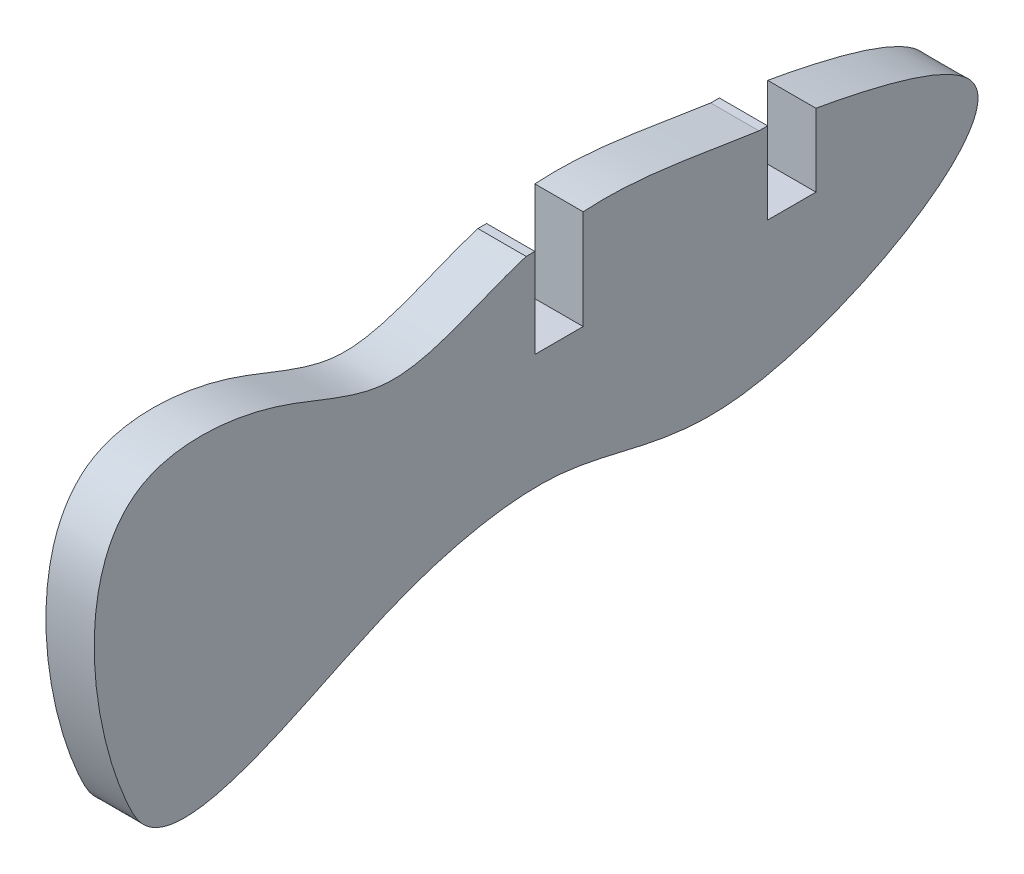
ISO-10303-21;
HEADER;
FILE_DESCRIPTION(('STEP AP214'),'2;1');
FILE_NAME('part.step','',(''),(''),'','','');
FILE_SCHEMA(('AUTOMOTIVE_DESIGN { 1 0 10303 214 1 1 1 1 }'));
ENDSEC;
DATA;
#1=APPLICATION_CONTEXT('core data for automotive mechanical design processes');
#2=APPLICATION_PROTOCOL_DEFINITION('international standard','automotive_design',2000,#1);
#3=PRODUCT_CONTEXT('',#1,'mechanical');
#4=PRODUCT('Part','Part','',(#3));
#5=PRODUCT_RELATED_PRODUCT_CATEGORY('part','',(#4));
#6=PRODUCT_DEFINITION_FORMATION('','',#4);
#7=PRODUCT_DEFINITION_CONTEXT('part definition',#1,'design');
#8=PRODUCT_DEFINITION('design','',#6,#7);
#9=PRODUCT_DEFINITION_SHAPE('','',#8);
#10=(LENGTH_UNIT() NAMED_UNIT(*) SI_UNIT(.MILLI.,.METRE.));
#11=(NAMED_UNIT(*) PLANE_ANGLE_UNIT() SI_UNIT($,.RADIAN.));
#12=(NAMED_UNIT(*) SI_UNIT($,.STERADIAN.) SOLID_ANGLE_UNIT());
#13=UNCERTAINTY_MEASURE_WITH_UNIT(LENGTH_MEASURE(1.E-05),#10,'distance_accuracy_value','');
#14=(GEOMETRIC_REPRESENTATION_CONTEXT(3) GLOBAL_UNCERTAINTY_ASSIGNED_CONTEXT((#13)) GLOBAL_UNIT_ASSIGNED_CONTEXT((#10,
#11,#12)) REPRESENTATION_CONTEXT('',''));
#15=CARTESIAN_POINT('',(0.,0.,0.));
#16=DIRECTION('',(0.,0.,1.));
#17=DIRECTION('',(1.,0.,0.));
#18=AXIS2_PLACEMENT_3D('',#15,#16,#17);
#19=CARTESIAN_POINT('',(-3.,14.1096357566499,-36.9591158688873));
#20=DIRECTION('',(1.,0.,0.));
#21=DIRECTION('',(0.,0.,-1.));
#22=AXIS2_PLACEMENT_3D('',#19,#20,#21);
#23=PLANE('',#22);
#24=DIRECTION('',(0.,0.,1.));
#25=VECTOR('',#24,1.);
#26=CARTESIAN_POINT('',(-3.,14.9506598821932,-32.05));
#27=LINE('',#26,#25);
#28=CARTESIAN_POINT('',(-3.,14.9506598821932,-32.5));
#29=VERTEX_POINT('',#28);
#30=CARTESIAN_POINT('',(-3.,14.9506598821932,-32.05));
#31=VERTEX_POINT('',#30);
#32=EDGE_CURVE('E125',#29,#31,#27,.T.);
#33=ORIENTED_EDGE('',*,*,#32,.T.);
#34=CARTESIAN_POINT('',(-3.,0.,0.));
#35=CARTESIAN_POINT('',(-3.,-2.10148899975761,-1.66824242640622));
#36=CARTESIAN_POINT('',(-3.,0.830537742946597,-8.40243383356885));
#37=CARTESIAN_POINT('',(-3.,3.85917268310027,-14.2712684107008));
#38=CARTESIAN_POINT('',(-3.,5.60522810441731,-22.4185256442143));
#39=CARTESIAN_POINT('',(-3.,1.00861388127118,-31.161172034736));
#40=CARTESIAN_POINT('',(-3.,10.8666316204562,-48.5539259527911));
#41=CARTESIAN_POINT('',(-3.,14.3286116729627,-36.875001757179));
#42=CARTESIAN_POINT('',(-3.,15.1694073837685,-29.9079989126778));
#43=CARTESIAN_POINT('',(-3.,16.9302814357476,-21.2011380590038));
#44=CARTESIAN_POINT('',(-3.,11.9338438664277,-13.4360646383816));
#45=CARTESIAN_POINT('',(-3.,15.6501057152965,-7.10719668173799));
#46=CARTESIAN_POINT('',(-3.,16.4810271321078,3.85111381370628));
#47=CARTESIAN_POINT('',(-3.,4.93290760788079,2.56569198647616));
#48=CARTESIAN_POINT('',(-3.,0.304319116234114,0.241580165742837));
#49=CARTESIAN_POINT('',(-3.,0.,0.));
#50=B_SPLINE_CURVE_WITH_KNOTS('',3,(#34,#35,#36,#37,#38,#39,#40,#41,#42,#43,#44,#45,#46,#47,#48,
#49),.UNSPECIFIED.,.T.,.F.,(4,1,1,1,1,1,1,1,1,1,1,1,1,4),(0.,0.082216534757164,
0.139216971510649,0.210483647825713,0.297081423388833,0.437894771987151,0.494452543094056,
0.559622012948284,0.657118762816807,0.731041248773184,0.790062711821896,0.856751927191223,
0.988094126022065,1.),.UNSPECIFIED.);
#51=CARTESIAN_POINT('',(-3.,15.8747427119938,-22.95));
#52=VERTEX_POINT('',#51);
#53=EDGE_CURVE('E217',#31,#52,#50,.T.);
#54=ORIENTED_EDGE('',*,*,#53,.T.);
#55=DIRECTION('',(0.,1.,0.));
#56=VECTOR('',#55,1.);
#57=CARTESIAN_POINT('',(-3.,15.909551198777,-22.95));
#58=LINE('',#57,#56);
#59=CARTESIAN_POINT('',(-3.,10.7286242334819,-22.95));
#60=VERTEX_POINT('',#59);
#61=EDGE_CURVE('E201',#60,#52,#58,.T.);
#62=ORIENTED_EDGE('',*,*,#61,.F.);
#63=DIRECTION('',(0.,0.,1.));
#64=VECTOR('',#63,1.);
#65=CARTESIAN_POINT('',(-3.,10.7286242334819,-22.95));
#66=LINE('',#65,#64);
#67=CARTESIAN_POINT('',(-3.,10.7286242334819,-20.45));
#68=VERTEX_POINT('',#67);
#69=EDGE_CURVE('E206',#60,#68,#66,.T.);
#70=ORIENTED_EDGE('',*,*,#69,.T.);
#71=DIRECTION('',(0.,1.,0.));
#72=VECTOR('',#71,1.);
#73=CARTESIAN_POINT('',(-3.,15.3475408108748,-20.45));
#74=LINE('',#73,#72);
#75=CARTESIAN_POINT('',(-3.,15.3475408108748,-20.45));
#76=VERTEX_POINT('',#75);
#77=EDGE_CURVE('E129',#68,#76,#74,.T.);
#78=ORIENTED_EDGE('',*,*,#77,.T.);
#79=DIRECTION('',(0.,0.,1.));
#80=VECTOR('',#79,1.);
#81=CARTESIAN_POINT('',(-3.,15.3475408108748,-20.0000000000005));
#82=LINE('',#81,#80);
#83=CARTESIAN_POINT('',(-3.,15.3475408108748,-20.0000000000005));
#84=VERTEX_POINT('',#83);
#85=EDGE_CURVE('E155',#76,#84,#82,.T.);
#86=ORIENTED_EDGE('',*,*,#85,.T.);
#87=CARTESIAN_POINT('',(-3.,14.4882185526725,-35.));
#88=VERTEX_POINT('',#87);
#89=EDGE_CURVE('E218',#84,#88,#50,.T.);
#90=ORIENTED_EDGE('',*,*,#89,.T.);
#91=DIRECTION('',(0.,1.,0.));
#92=VECTOR('',#91,1.);
#93=CARTESIAN_POINT('',(-3.,15.909551198777,-35.));
#94=LINE('',#93,#92);
#95=CARTESIAN_POINT('',(-3.,10.7286242334819,-35.));
#96=VERTEX_POINT('',#95);
#97=EDGE_CURVE('E168',#96,#88,#94,.T.);
#98=ORIENTED_EDGE('',*,*,#97,.F.);
#99=DIRECTION('',(0.,0.,-1.));
#100=VECTOR('',#99,1.);
#101=CARTESIAN_POINT('',(-3.,10.7286242334819,-32.05));
#102=LINE('',#101,#100);
#103=CARTESIAN_POINT('',(-3.,10.7286242334819,-32.5));
#104=VERTEX_POINT('',#103);
#105=EDGE_CURVE('E181',#104,#96,#102,.T.);
#106=ORIENTED_EDGE('',*,*,#105,.F.);
#107=DIRECTION('',(0.,1.,0.));
#108=VECTOR('',#107,1.);
#109=CARTESIAN_POINT('',(-3.,14.9506598821932,-32.5));
#110=LINE('',#109,#108);
#111=EDGE_CURVE('E145',#104,#29,#110,.T.);
#112=ORIENTED_EDGE('',*,*,#111,.T.);
#113=EDGE_LOOP('',(#33,#54,#62,#70,#78,#86,#90,#98,#106,#112));
#114=FACE_BOUND('',#113,.T.);
#115=ADVANCED_FACE('F39',(#114),#23,.T.);
#116=CARTESIAN_POINT('',(-5.5,0.,0.));
#117=CARTESIAN_POINT('',(-5.5,-2.10148899975761,-1.66824242640622));
#118=CARTESIAN_POINT('',(-5.5,0.830537742946597,-8.40243383356885));
#119=CARTESIAN_POINT('',(-5.5,3.85917268310027,-14.2712684107008));
#120=CARTESIAN_POINT('',(-5.5,5.60522810441731,-22.4185256442143));
#121=CARTESIAN_POINT('',(-5.5,1.00861388127118,-31.161172034736));
#122=CARTESIAN_POINT('',(-5.5,10.8666316204562,-48.5539259527911));
#123=CARTESIAN_POINT('',(-5.5,14.3286116729627,-36.875001757179));
#124=CARTESIAN_POINT('',(-5.5,15.1694073837685,-29.9079989126778));
#125=CARTESIAN_POINT('',(-5.5,16.9302814357476,-21.2011380590038));
#126=CARTESIAN_POINT('',(-5.5,11.9338438664277,-13.4360646383816));
#127=CARTESIAN_POINT('',(-5.5,15.6501057152965,-7.10719668173799));
#128=CARTESIAN_POINT('',(-5.5,16.4810271321078,3.85111381370628));
#129=CARTESIAN_POINT('',(-5.5,4.93290760788079,2.56569198647616));
#130=CARTESIAN_POINT('',(-5.5,0.304319116234114,0.241580165742837));
#131=CARTESIAN_POINT('',(-5.5,0.,0.));
#132=B_SPLINE_CURVE_WITH_KNOTS('',3,(#116,#117,#118,#119,#120,#121,#122,#123,#124,#125,#126,
#127,#128,#129,#130,#131),.UNSPECIFIED.,.T.,.F.,(4,1,1,1,1,1,1,1,1,1,1,1,1,4),(0.,
0.082216534757164,0.139216971510649,0.210483647825713,0.297081423388833,0.437894771987151,
0.494452543094056,0.559622012948284,0.657118762816807,0.731041248773184,0.790062711821896,
0.856751927191223,0.988094126022065,1.),.UNSPECIFIED.);
#133=DIRECTION('',(1.,0.,0.));
#134=VECTOR('',#133,1.);
#135=SURFACE_OF_LINEAR_EXTRUSION('',#132,#134);
#136=DIRECTION('',(1.,0.,0.));
#137=VECTOR('',#136,1.);
#138=CARTESIAN_POINT('',(-5.5,14.9506598836708,-32.05));
#139=LINE('',#138,#137);
#140=CARTESIAN_POINT('',(-5.5,14.9506598821932,-32.05));
#141=VERTEX_POINT('',#140);
#142=EDGE_CURVE('E191',#141,#31,#139,.T.);
#143=ORIENTED_EDGE('',*,*,#142,.F.);
#144=CARTESIAN_POINT('',(-5.5,15.8747427119938,-22.95));
#145=VERTEX_POINT('',#144);
#146=EDGE_CURVE('E51',#141,#145,#132,.T.);
#147=ORIENTED_EDGE('',*,*,#146,.T.);
#148=DIRECTION('',(1.,0.,0.));
#149=VECTOR('',#148,1.);
#150=CARTESIAN_POINT('',(-5.5,15.8747427129041,-22.95));
#151=LINE('',#150,#149);
#152=EDGE_CURVE('E214',#52,#145,#151,.F.);
#153=ORIENTED_EDGE('',*,*,#152,.F.);
#154=ORIENTED_EDGE('',*,*,#53,.F.);
#155=EDGE_LOOP('',(#143,#147,#153,#154));
#156=FACE_BOUND('',#155,.T.);
#157=ADVANCED_FACE('F41',(#156),#135,.T.);
#158=CARTESIAN_POINT('',(-5.5,15.3475408108748,-20.));
#159=VERTEX_POINT('',#158);
#160=CARTESIAN_POINT('',(-5.5,14.4882185526725,-35.));
#161=VERTEX_POINT('',#160);
#162=EDGE_CURVE('E11',#159,#161,#132,.T.);
#163=ORIENTED_EDGE('',*,*,#162,.T.);
#164=DIRECTION('',(1.,0.,0.));
#165=VECTOR('',#164,1.);
#166=CARTESIAN_POINT('',(-5.5,14.4882185526727,-35.));
#167=LINE('',#166,#165);
#168=EDGE_CURVE('E187',#161,#88,#167,.T.);
#169=ORIENTED_EDGE('',*,*,#168,.T.);
#170=ORIENTED_EDGE('',*,*,#89,.F.);
#171=DIRECTION('',(1.,0.,0.));
#172=VECTOR('',#171,1.);
#173=CARTESIAN_POINT('',(-5.5,15.3475408108746,-20.));
#174=LINE('',#173,#172);
#175=EDGE_CURVE('E209',#84,#159,#174,.F.);
#176=ORIENTED_EDGE('',*,*,#175,.T.);
#177=EDGE_LOOP('',(#163,#169,#170,#176));
#178=FACE_BOUND('',#177,.T.);
#179=ADVANCED_FACE('F238',(#178),#135,.T.);
#180=CARTESIAN_POINT('',(-3.,10.7286242334819,-32.05));
#181=DIRECTION('',(0.,-1.,0.));
#182=DIRECTION('',(0.,0.,1.));
#183=AXIS2_PLACEMENT_3D('',#180,#181,#182);
#184=PLANE('',#183);
#185=DIRECTION('',(0.,0.,-1.));
#186=VECTOR('',#185,1.);
#187=CARTESIAN_POINT('',(-5.5,10.7286242334819,-32.05));
#188=LINE('',#187,#186);
#189=CARTESIAN_POINT('',(-5.5,10.7286242334819,-32.5));
#190=VERTEX_POINT('',#189);
#191=CARTESIAN_POINT('',(-5.5,10.7286242334819,-35.));
#192=VERTEX_POINT('',#191);
#193=EDGE_CURVE('E184',#190,#192,#188,.T.);
#194=ORIENTED_EDGE('',*,*,#193,.F.);
#195=DIRECTION('',(1.,0.,0.));
#196=VECTOR('',#195,1.);
#197=CARTESIAN_POINT('',(-5.5,10.7286242334819,-32.5));
#198=LINE('',#197,#196);
#199=EDGE_CURVE('E130',#190,#104,#198,.T.);
#200=ORIENTED_EDGE('',*,*,#199,.T.);
#201=ORIENTED_EDGE('',*,*,#105,.T.);
#202=DIRECTION('',(1.,0.,0.));
#203=VECTOR('',#202,1.);
#204=CARTESIAN_POINT('',(-3.,10.7286242334819,-35.));
#205=LINE('',#204,#203);
#206=EDGE_CURVE('E173',#192,#96,#205,.T.);
#207=ORIENTED_EDGE('',*,*,#206,.F.);
#208=EDGE_LOOP('',(#194,#200,#201,#207));
#209=FACE_BOUND('',#208,.T.);
#210=ADVANCED_FACE('F243',(#209),#184,.F.);
#211=CARTESIAN_POINT('',(0.,0.,-35.));
#212=DIRECTION('',(0.,0.,1.));
#213=DIRECTION('',(-1.,0.,0.));
#214=AXIS2_PLACEMENT_3D('',#211,#212,#213);
#215=PLANE('',#214);
#216=DIRECTION('',(0.,-1.,0.));
#217=VECTOR('',#216,1.);
#218=CARTESIAN_POINT('',(-5.5,15.909551198777,-35.));
#219=LINE('',#218,#217);
#220=EDGE_CURVE('E177',#161,#192,#219,.T.);
#221=ORIENTED_EDGE('',*,*,#220,.T.);
#222=ORIENTED_EDGE('',*,*,#206,.T.);
#223=ORIENTED_EDGE('',*,*,#97,.T.);
#224=ORIENTED_EDGE('',*,*,#168,.F.);
#225=EDGE_LOOP('',(#221,#222,#223,#224));
#226=FACE_BOUND('',#225,.T.);
#227=ADVANCED_FACE('F258',(#226),#215,.T.);
#228=CARTESIAN_POINT('',(-3.,10.7286242334819,-22.95));
#229=DIRECTION('',(0.,-1.,0.));
#230=DIRECTION('',(0.,0.,-1.));
#231=AXIS2_PLACEMENT_3D('',#228,#229,#230);
#232=PLANE('',#231);
#233=DIRECTION('',(0.,0.,1.));
#234=VECTOR('',#233,1.);
#235=CARTESIAN_POINT('',(-5.5,10.7286242334819,-22.95));
#236=LINE('',#235,#234);
#237=CARTESIAN_POINT('',(-5.5,10.7286242334819,-22.95));
#238=VERTEX_POINT('',#237);
#239=CARTESIAN_POINT('',(-5.5,10.7286242334819,-20.45));
#240=VERTEX_POINT('',#239);
#241=EDGE_CURVE('E205',#238,#240,#236,.T.);
#242=ORIENTED_EDGE('',*,*,#241,.T.);
#243=DIRECTION('',(1.,0.,0.));
#244=VECTOR('',#243,1.);
#245=CARTESIAN_POINT('',(-5.5,10.7286242334819,-20.45));
#246=LINE('',#245,#244);
#247=EDGE_CURVE('E66',#240,#68,#246,.T.);
#248=ORIENTED_EDGE('',*,*,#247,.T.);
#249=ORIENTED_EDGE('',*,*,#69,.F.);
#250=DIRECTION('',(1.,0.,0.));
#251=VECTOR('',#250,1.);
#252=CARTESIAN_POINT('',(-3.,10.7286242334819,-22.95));
#253=LINE('',#252,#251);
#254=EDGE_CURVE('E197',#238,#60,#253,.T.);
#255=ORIENTED_EDGE('',*,*,#254,.F.);
#256=EDGE_LOOP('',(#242,#248,#249,#255));
#257=FACE_BOUND('',#256,.T.);
#258=ADVANCED_FACE('F252',(#257),#232,.F.);
#259=CARTESIAN_POINT('',(0.,0.,-22.95));
#260=DIRECTION('',(0.,0.,-1.));
#261=DIRECTION('',(-1.,0.,0.));
#262=AXIS2_PLACEMENT_3D('',#259,#260,#261);
#263=PLANE('',#262);
#264=ORIENTED_EDGE('',*,*,#152,.T.);
#265=DIRECTION('',(0.,-1.,0.));
#266=VECTOR('',#265,1.);
#267=CARTESIAN_POINT('',(-5.5,15.909551198777,-22.95));
#268=LINE('',#267,#266);
#269=EDGE_CURVE('E194',#145,#238,#268,.T.);
#270=ORIENTED_EDGE('',*,*,#269,.T.);
#271=ORIENTED_EDGE('',*,*,#254,.T.);
#272=ORIENTED_EDGE('',*,*,#61,.T.);
#273=EDGE_LOOP('',(#264,#270,#271,#272));
#274=FACE_BOUND('',#273,.T.);
#275=ADVANCED_FACE('F235',(#274),#263,.F.);
#276=CARTESIAN_POINT('',(-5.5,14.1096357566499,-36.9591158688873));
#277=DIRECTION('',(1.,0.,0.));
#278=DIRECTION('',(0.,0.,-1.));
#279=AXIS2_PLACEMENT_3D('',#276,#277,#278);
#280=PLANE('',#279);
#281=ORIENTED_EDGE('',*,*,#146,.F.);
#282=DIRECTION('',(0.,0.,1.));
#283=VECTOR('',#282,1.);
#284=CARTESIAN_POINT('',(-5.5,14.9506598821932,-32.05));
#285=LINE('',#284,#283);
#286=CARTESIAN_POINT('',(-5.5,14.9506598821932,-32.5));
#287=VERTEX_POINT('',#286);
#288=EDGE_CURVE('E122',#287,#141,#285,.T.);
#289=ORIENTED_EDGE('',*,*,#288,.F.);
#290=DIRECTION('',(0.,1.,0.));
#291=VECTOR('',#290,1.);
#292=CARTESIAN_POINT('',(-5.5,14.9506598821932,-32.5));
#293=LINE('',#292,#291);
#294=EDGE_CURVE('E58',#190,#287,#293,.T.);
#295=ORIENTED_EDGE('',*,*,#294,.F.);
#296=ORIENTED_EDGE('',*,*,#193,.T.);
#297=ORIENTED_EDGE('',*,*,#220,.F.);
#298=ORIENTED_EDGE('',*,*,#162,.F.);
#299=DIRECTION('',(0.,0.,1.));
#300=VECTOR('',#299,1.);
#301=CARTESIAN_POINT('',(-5.5,15.3475408108748,-20.0000000000005));
#302=LINE('',#301,#300);
#303=CARTESIAN_POINT('',(-5.5,15.3475408108748,-20.45));
#304=VERTEX_POINT('',#303);
#305=EDGE_CURVE('E154',#304,#159,#302,.T.);
#306=ORIENTED_EDGE('',*,*,#305,.F.);
#307=DIRECTION('',(0.,1.,0.));
#308=VECTOR('',#307,1.);
#309=CARTESIAN_POINT('',(-5.5,15.3475408108748,-20.45));
#310=LINE('',#309,#308);
#311=EDGE_CURVE('E150',#240,#304,#310,.T.);
#312=ORIENTED_EDGE('',*,*,#311,.F.);
#313=ORIENTED_EDGE('',*,*,#241,.F.);
#314=ORIENTED_EDGE('',*,*,#269,.F.);
#315=EDGE_LOOP('',(#281,#289,#295,#296,#297,#298,#306,#312,#313,#314));
#316=FACE_BOUND('',#315,.T.);
#317=ADVANCED_FACE('F138',(#316),#280,.F.);
#318=CARTESIAN_POINT('',(-5.5,15.3475408108748,-20.0000000000005));
#319=DIRECTION('',(0.,1.,0.));
#320=DIRECTION('',(0.,0.,1.));
#321=AXIS2_PLACEMENT_3D('',#318,#319,#320);
#322=PLANE('',#321);
#323=ORIENTED_EDGE('',*,*,#85,.F.);
#324=DIRECTION('',(1.,0.,0.));
#325=VECTOR('',#324,1.);
#326=CARTESIAN_POINT('',(-5.5,15.3475408108748,-20.45));
#327=LINE('',#326,#325);
#328=EDGE_CURVE('E165',#304,#76,#327,.T.);
#329=ORIENTED_EDGE('',*,*,#328,.F.);
#330=ORIENTED_EDGE('',*,*,#305,.T.);
#331=ORIENTED_EDGE('',*,*,#175,.F.);
#332=EDGE_LOOP('',(#323,#329,#330,#331));
#333=FACE_BOUND('',#332,.T.);
#334=ADVANCED_FACE('F251',(#333),#322,.T.);
#335=CARTESIAN_POINT('',(-5.5,15.3475408108748,-20.45));
#336=DIRECTION('',(0.,0.,-1.));
#337=DIRECTION('',(-1.,0.,0.));
#338=AXIS2_PLACEMENT_3D('',#335,#336,#337);
#339=PLANE('',#338);
#340=ORIENTED_EDGE('',*,*,#77,.F.);
#341=ORIENTED_EDGE('',*,*,#247,.F.);
#342=ORIENTED_EDGE('',*,*,#311,.T.);
#343=ORIENTED_EDGE('',*,*,#328,.T.);
#344=EDGE_LOOP('',(#340,#341,#342,#343));
#345=FACE_BOUND('',#344,.T.);
#346=ADVANCED_FACE('F266',(#345),#339,.T.);
#347=CARTESIAN_POINT('',(-5.5,14.9506598821932,-32.05));
#348=DIRECTION('',(0.,1.,0.));
#349=DIRECTION('',(0.,0.,1.));
#350=AXIS2_PLACEMENT_3D('',#347,#348,#349);
#351=PLANE('',#350);
#352=ORIENTED_EDGE('',*,*,#32,.F.);
#353=DIRECTION('',(1.,0.,0.));
#354=VECTOR('',#353,1.);
#355=CARTESIAN_POINT('',(-5.5,14.9506598821932,-32.5));
#356=LINE('',#355,#354);
#357=EDGE_CURVE('E120',#287,#29,#356,.T.);
#358=ORIENTED_EDGE('',*,*,#357,.F.);
#359=ORIENTED_EDGE('',*,*,#288,.T.);
#360=ORIENTED_EDGE('',*,*,#142,.T.);
#361=EDGE_LOOP('',(#352,#358,#359,#360));
#362=FACE_BOUND('',#361,.T.);
#363=ADVANCED_FACE('F121',(#362),#351,.T.);
#364=CARTESIAN_POINT('',(-5.5,14.9506598821932,-32.5));
#365=DIRECTION('',(0.,0.,-1.));
#366=DIRECTION('',(-1.,0.,0.));
#367=AXIS2_PLACEMENT_3D('',#364,#365,#366);
#368=PLANE('',#367);
#369=ORIENTED_EDGE('',*,*,#111,.F.);
#370=ORIENTED_EDGE('',*,*,#199,.F.);
#371=ORIENTED_EDGE('',*,*,#294,.T.);
#372=ORIENTED_EDGE('',*,*,#357,.T.);
#373=EDGE_LOOP('',(#369,#370,#371,#372));
#374=FACE_BOUND('',#373,.T.);
#375=ADVANCED_FACE('F132',(#374),#368,.T.);
#376=CLOSED_SHELL('',(#115,#157,#179,#210,#227,#258,#275,#317,#334,#346,#363,#375));
#377=MANIFOLD_SOLID_BREP('B2',#376);
#378=ADVANCED_BREP_SHAPE_REPRESENTATION('',(#18,#377),#14);
#379=SHAPE_DEFINITION_REPRESENTATION(#9,#378);
ENDSEC;
END-ISO-10303-21;
